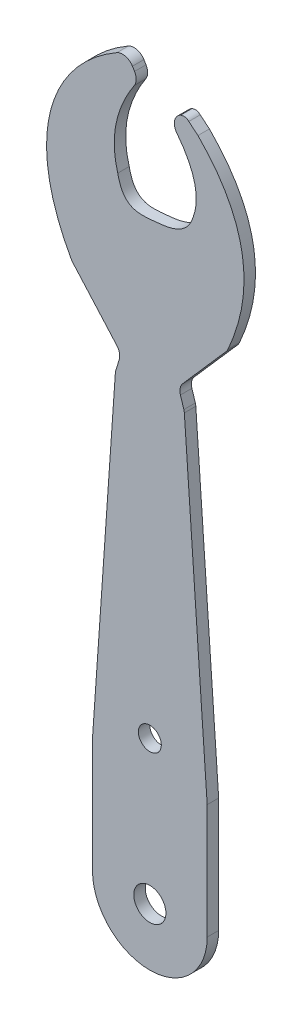
ISO-10303-21;
HEADER;
FILE_DESCRIPTION(('STEP AP214'),'2;1');
FILE_NAME('part.step','',(''),(''),'','','');
FILE_SCHEMA(('AUTOMOTIVE_DESIGN { 1 0 10303 214 1 1 1 1 }'));
ENDSEC;
DATA;
#1=APPLICATION_CONTEXT('core data for automotive mechanical design processes');
#2=APPLICATION_PROTOCOL_DEFINITION('international standard','automotive_design',2000,#1);
#3=PRODUCT_CONTEXT('',#1,'mechanical');
#4=PRODUCT('Part','Part','',(#3));
#5=PRODUCT_RELATED_PRODUCT_CATEGORY('part','',(#4));
#6=PRODUCT_DEFINITION_FORMATION('','',#4);
#7=PRODUCT_DEFINITION_CONTEXT('part definition',#1,'design');
#8=PRODUCT_DEFINITION('design','',#6,#7);
#9=PRODUCT_DEFINITION_SHAPE('','',#8);
#10=(LENGTH_UNIT() NAMED_UNIT(*) SI_UNIT(.MILLI.,.METRE.));
#11=(NAMED_UNIT(*) PLANE_ANGLE_UNIT() SI_UNIT($,.RADIAN.));
#12=(NAMED_UNIT(*) SI_UNIT($,.STERADIAN.) SOLID_ANGLE_UNIT());
#13=UNCERTAINTY_MEASURE_WITH_UNIT(LENGTH_MEASURE(1.E-05),#10,'distance_accuracy_value','');
#14=(GEOMETRIC_REPRESENTATION_CONTEXT(3) GLOBAL_UNCERTAINTY_ASSIGNED_CONTEXT((#13)) GLOBAL_UNIT_ASSIGNED_CONTEXT((#10,
#11,#12)) REPRESENTATION_CONTEXT('',''));
#15=CARTESIAN_POINT('',(0.,0.,0.));
#16=DIRECTION('',(0.,0.,1.));
#17=DIRECTION('',(1.,0.,0.));
#18=AXIS2_PLACEMENT_3D('',#15,#16,#17);
#19=CARTESIAN_POINT('',(42.3332363976536,47.0795023680889,-1.));
#20=CARTESIAN_POINT('',(40.7644229268928,46.1744890731007,-1.));
#21=CARTESIAN_POINT('',(35.8165484060871,41.9007478210855,-1.));
#22=CARTESIAN_POINT('',(35.2720836443385,35.0019493386589,-1.));
#23=CARTESIAN_POINT('',(38.3597162741337,29.485408265831,-1.));
#24=B_SPLINE_CURVE_WITH_KNOTS('',3,(#19,#20,#21,#22,#23),.UNSPECIFIED.,.F.,.F.,(4,1,4),
(0.0040027377368663,0.255811026156907,0.955465838183114),.UNSPECIFIED.);
#25=DIRECTION('',(0.,0.,1.));
#26=VECTOR('',#25,1.);
#27=SURFACE_OF_LINEAR_EXTRUSION('',#24,#26);
#28=CARTESIAN_POINT('',(42.3332363976536,47.0795023680889,0.));
#29=CARTESIAN_POINT('',(40.7644229268928,46.1744890731007,0.));
#30=CARTESIAN_POINT('',(35.8165484060871,41.9007478210855,0.));
#31=CARTESIAN_POINT('',(35.2720836443385,35.0019493386589,0.));
#32=CARTESIAN_POINT('',(38.3597162741337,29.485408265831,0.));
#33=B_SPLINE_CURVE_WITH_KNOTS('',3,(#28,#29,#30,#31,#32),.UNSPECIFIED.,.F.,.F.,(4,1,4),
(0.0040027377368663,0.255811026156907,0.955465838183114),.UNSPECIFIED.);
#34=CARTESIAN_POINT('',(42.3332363976536,47.0795023680889,0.));
#35=VERTEX_POINT('',#34);
#36=CARTESIAN_POINT('',(38.3597162741337,29.485408265831,0.));
#37=VERTEX_POINT('',#36);
#38=EDGE_CURVE('E246',#35,#37,#33,.T.);
#39=ORIENTED_EDGE('',*,*,#38,.F.);
#40=DIRECTION('',(0.,0.,1.));
#41=VECTOR('',#40,1.);
#42=CARTESIAN_POINT('',(42.3332363976536,47.0795023680889,-1.));
#43=LINE('',#42,#41);
#44=CARTESIAN_POINT('',(42.3332363976536,47.0795023680889,-1.));
#45=VERTEX_POINT('',#44);
#46=EDGE_CURVE('E11',#45,#35,#43,.T.);
#47=ORIENTED_EDGE('',*,*,#46,.F.);
#48=CARTESIAN_POINT('',(38.3597162741337,29.485408265831,-1.));
#49=VERTEX_POINT('',#48);
#50=EDGE_CURVE('E351',#45,#49,#24,.T.);
#51=ORIENTED_EDGE('',*,*,#50,.T.);
#52=DIRECTION('',(0.,0.,1.));
#53=VECTOR('',#52,1.);
#54=CARTESIAN_POINT('',(38.3597162741337,29.485408265831,-1.));
#55=LINE('',#54,#53);
#56=EDGE_CURVE('E41',#49,#37,#55,.T.);
#57=ORIENTED_EDGE('',*,*,#56,.T.);
#58=EDGE_LOOP('',(#39,#47,#51,#57));
#59=FACE_BOUND('',#58,.T.);
#60=ADVANCED_FACE('F37',(#59),#27,.T.);
#61=CARTESIAN_POINT('',(42.8329292730268,46.2132997184155,-1.));
#62=DIRECTION('',(0.,0.,1.));
#63=DIRECTION('',(1.,0.,0.));
#64=AXIS2_PLACEMENT_3D('',#61,#62,#63);
#65=CYLINDRICAL_SURFACE('',#64,0.999999999999974);
#66=CARTESIAN_POINT('',(42.8329292730268,46.2132997184155,0.));
#67=DIRECTION('',(0.,0.,1.));
#68=DIRECTION('',(1.,0.,0.));
#69=AXIS2_PLACEMENT_3D('',#66,#67,#68);
#70=CIRCLE('',#69,0.999999999999974);
#71=CARTESIAN_POINT('',(43.6882735895,46.7313596573,0.));
#72=VERTEX_POINT('',#71);
#73=EDGE_CURVE('E349',#72,#35,#70,.T.);
#74=ORIENTED_EDGE('',*,*,#73,.F.);
#75=DIRECTION('',(0.,0.,1.));
#76=VECTOR('',#75,1.);
#77=CARTESIAN_POINT('',(43.6882735895,46.7313596573,-1.));
#78=LINE('',#77,#76);
#79=CARTESIAN_POINT('',(43.6882735895,46.7313596573,-1.));
#80=VERTEX_POINT('',#79);
#81=EDGE_CURVE('E47',#80,#72,#78,.T.);
#82=ORIENTED_EDGE('',*,*,#81,.F.);
#83=CARTESIAN_POINT('',(42.8329292730268,46.2132997184155,-1.));
#84=DIRECTION('',(0.,0.,1.));
#85=DIRECTION('',(1.,0.,0.));
#86=AXIS2_PLACEMENT_3D('',#83,#84,#85);
#87=CIRCLE('',#86,0.999999999999974);
#88=EDGE_CURVE('E233',#80,#45,#87,.T.);
#89=ORIENTED_EDGE('',*,*,#88,.T.);
#90=ORIENTED_EDGE('',*,*,#46,.T.);
#91=EDGE_LOOP('',(#74,#82,#89,#90));
#92=FACE_BOUND('',#91,.T.);
#93=ADVANCED_FACE('F399',(#92),#65,.T.);
#94=CARTESIAN_POINT('',(43.8714355775,46.4289495427,-1.));
#95=DIRECTION('',(0.855344316558168,0.518059938744197,0.));
#96=DIRECTION('',(-0.518059938744197,0.855344316558168,0.));
#97=AXIS2_PLACEMENT_3D('',#94,#95,#96);
#98=PLANE('',#97);
#99=DIRECTION('',(-0.518059938744197,0.855344316558168,0.));
#100=VECTOR('',#99,1.);
#101=CARTESIAN_POINT('',(43.8714355775,46.4289495427,0.));
#102=LINE('',#101,#100);
#103=CARTESIAN_POINT('',(43.8714355775,46.4289495427,0.));
#104=VERTEX_POINT('',#103);
#105=EDGE_CURVE('E220',#104,#72,#102,.T.);
#106=ORIENTED_EDGE('',*,*,#105,.F.);
#107=DIRECTION('',(0.,0.,1.));
#108=VECTOR('',#107,1.);
#109=CARTESIAN_POINT('',(43.8714355775,46.4289495427,-1.));
#110=LINE('',#109,#108);
#111=CARTESIAN_POINT('',(43.8714355775,46.4289495427,-1.));
#112=VERTEX_POINT('',#111);
#113=EDGE_CURVE('E215',#112,#104,#110,.T.);
#114=ORIENTED_EDGE('',*,*,#113,.F.);
#115=DIRECTION('',(-0.518059938744197,0.855344316558168,0.));
#116=VECTOR('',#115,1.);
#117=CARTESIAN_POINT('',(43.8714355775,46.4289495427,-1.));
#118=LINE('',#117,#116);
#119=EDGE_CURVE('E218',#112,#80,#118,.T.);
#120=ORIENTED_EDGE('',*,*,#119,.T.);
#121=ORIENTED_EDGE('',*,*,#81,.T.);
#122=EDGE_LOOP('',(#106,#114,#120,#121));
#123=FACE_BOUND('',#122,.T.);
#124=ADVANCED_FACE('F217',(#123),#98,.T.);
#125=CARTESIAN_POINT('',(43.0160912610668,45.9108896037495,-1.));
#126=DIRECTION('',(0.,0.,1.));
#127=DIRECTION('',(1.,0.,0.));
#128=AXIS2_PLACEMENT_3D('',#125,#126,#127);
#129=CYLINDRICAL_SURFACE('',#128,1.00000000000002);
#130=CARTESIAN_POINT('',(43.0160912610668,45.9108896037495,0.));
#131=DIRECTION('',(0.,0.,1.));
#132=DIRECTION('',(1.,0.,0.));
#133=AXIS2_PLACEMENT_3D('',#130,#131,#132);
#134=CIRCLE('',#133,1.00000000000002);
#135=CARTESIAN_POINT('',(43.8516614433843,45.3615058850046,0.));
#136=VERTEX_POINT('',#135);
#137=EDGE_CURVE('E343',#136,#104,#134,.T.);
#138=ORIENTED_EDGE('',*,*,#137,.F.);
#139=DIRECTION('',(0.,0.,1.));
#140=VECTOR('',#139,1.);
#141=CARTESIAN_POINT('',(43.8516614433843,45.3615058850046,-1.));
#142=LINE('',#141,#140);
#143=CARTESIAN_POINT('',(43.8516614433843,45.3615058850046,-1.));
#144=VERTEX_POINT('',#143);
#145=EDGE_CURVE('E225',#144,#136,#142,.T.);
#146=ORIENTED_EDGE('',*,*,#145,.F.);
#147=CARTESIAN_POINT('',(43.0160912610668,45.9108896037495,-1.));
#148=DIRECTION('',(0.,0.,1.));
#149=DIRECTION('',(1.,0.,0.));
#150=AXIS2_PLACEMENT_3D('',#147,#148,#149);
#151=CIRCLE('',#150,1.00000000000002);
#152=EDGE_CURVE('E231',#144,#112,#151,.T.);
#153=ORIENTED_EDGE('',*,*,#152,.T.);
#154=ORIENTED_EDGE('',*,*,#113,.T.);
#155=EDGE_LOOP('',(#138,#146,#153,#154));
#156=FACE_BOUND('',#155,.T.);
#157=ADVANCED_FACE('F235',(#156),#129,.T.);
#158=CARTESIAN_POINT('',(42.4075432932274,38.0174935312511,-1.));
#159=CARTESIAN_POINT('',(42.322809157617,38.3080987068289,-1.));
#160=CARTESIAN_POINT('',(41.7731764836035,40.6941570879392,-1.));
#161=CARTESIAN_POINT('',(42.3981238843577,43.1507875809266,-1.));
#162=CARTESIAN_POINT('',(43.8516614433843,45.3615058850046,-1.));
#163=B_SPLINE_CURVE_WITH_KNOTS('',3,(#158,#159,#160,#161,#162),.UNSPECIFIED.,.F.,.F.,(4,1,4),
(0.0470284190260174,0.131515029794918,0.738210783890185),.UNSPECIFIED.);
#164=DIRECTION('',(0.,0.,1.));
#165=VECTOR('',#164,1.);
#166=SURFACE_OF_LINEAR_EXTRUSION('',#163,#165);
#167=CARTESIAN_POINT('',(42.4075432932274,38.0174935312511,0.));
#168=CARTESIAN_POINT('',(42.322809157617,38.3080987068289,0.));
#169=CARTESIAN_POINT('',(41.7731764836035,40.6941570879392,0.));
#170=CARTESIAN_POINT('',(42.3981238843577,43.1507875809266,0.));
#171=CARTESIAN_POINT('',(43.8516614433843,45.3615058850046,0.));
#172=B_SPLINE_CURVE_WITH_KNOTS('',3,(#167,#168,#169,#170,#171),.UNSPECIFIED.,.F.,.F.,(4,1,4),
(0.0470284190260174,0.131515029794918,0.738210783890185),.UNSPECIFIED.);
#173=CARTESIAN_POINT('',(42.4075432932274,38.0174935312511,0.));
#174=VERTEX_POINT('',#173);
#175=EDGE_CURVE('E335',#174,#136,#172,.T.);
#176=ORIENTED_EDGE('',*,*,#175,.F.);
#177=DIRECTION('',(0.,0.,1.));
#178=VECTOR('',#177,1.);
#179=CARTESIAN_POINT('',(42.4075432932274,38.0174935312511,-1.));
#180=LINE('',#179,#178);
#181=CARTESIAN_POINT('',(42.4075432932274,38.0174935312511,-1.));
#182=VERTEX_POINT('',#181);
#183=EDGE_CURVE('E355',#182,#174,#180,.T.);
#184=ORIENTED_EDGE('',*,*,#183,.F.);
#185=EDGE_CURVE('E236',#182,#144,#163,.T.);
#186=ORIENTED_EDGE('',*,*,#185,.T.);
#187=ORIENTED_EDGE('',*,*,#145,.T.);
#188=EDGE_LOOP('',(#176,#184,#186,#187));
#189=FACE_BOUND('',#188,.T.);
#190=ADVANCED_FACE('F412',(#189),#166,.T.);
#191=CARTESIAN_POINT('',(48.9681541994678,37.9390061551289,-1.));
#192=CARTESIAN_POINT('',(48.4075300306109,36.2495192598627,-1.));
#193=CARTESIAN_POINT('',(45.517280844346,35.9595964406139,-1.));
#194=CARTESIAN_POINT('',(42.8792154768876,35.7354947461931,-1.));
#195=CARTESIAN_POINT('',(42.4075432932274,38.0174935312511,-1.));
#196=B_SPLINE_CURVE_WITH_KNOTS('',3,(#191,#192,#193,#194,#195),.UNSPECIFIED.,.F.,.F.,(4,1,4),
(0.,0.520046033975967,1.),.UNSPECIFIED.);
#197=DIRECTION('',(0.,0.,1.));
#198=VECTOR('',#197,1.);
#199=SURFACE_OF_LINEAR_EXTRUSION('',#196,#198);
#200=CARTESIAN_POINT('',(48.9681541994678,37.9390061551289,0.));
#201=CARTESIAN_POINT('',(48.4075300306109,36.2495192598627,0.));
#202=CARTESIAN_POINT('',(45.517280844346,35.9595964406139,0.));
#203=CARTESIAN_POINT('',(42.8792154768876,35.7354947461931,0.));
#204=CARTESIAN_POINT('',(42.4075432932274,38.0174935312511,0.));
#205=B_SPLINE_CURVE_WITH_KNOTS('',3,(#200,#201,#202,#203,#204),.UNSPECIFIED.,.F.,.F.,(4,1,4),
(0.,0.520046033975967,1.),.UNSPECIFIED.);
#206=CARTESIAN_POINT('',(48.9681541994678,37.9390061551289,0.));
#207=VERTEX_POINT('',#206);
#208=EDGE_CURVE('E327',#207,#174,#205,.T.);
#209=ORIENTED_EDGE('',*,*,#208,.F.);
#210=DIRECTION('',(0.,0.,1.));
#211=VECTOR('',#210,1.);
#212=CARTESIAN_POINT('',(48.9681541994678,37.9390061551289,-1.));
#213=LINE('',#212,#211);
#214=CARTESIAN_POINT('',(48.9681541994678,37.9390061551289,-1.));
#215=VERTEX_POINT('',#214);
#216=EDGE_CURVE('E357',#215,#207,#213,.T.);
#217=ORIENTED_EDGE('',*,*,#216,.F.);
#218=EDGE_CURVE('E238',#215,#182,#196,.T.);
#219=ORIENTED_EDGE('',*,*,#218,.T.);
#220=ORIENTED_EDGE('',*,*,#183,.T.);
#221=EDGE_LOOP('',(#209,#217,#219,#220));
#222=FACE_BOUND('',#221,.T.);
#223=ADVANCED_FACE('F415',(#222),#199,.T.);
#224=CARTESIAN_POINT('',(47.535799978023,43.6486512493814,-1.));
#225=CARTESIAN_POINT('',(49.1164867980703,41.6205399356762,-1.));
#226=CARTESIAN_POINT('',(49.6339880714659,39.7324042372996,-1.));
#227=CARTESIAN_POINT('',(48.9681541994678,37.9390061551289,-1.));
#228=B_SPLINE_CURVE_WITH_KNOTS('',3,(#224,#225,#226,#227),.UNSPECIFIED.,.F.,.F.,(4,4),(0.,
0.676846711948636),.UNSPECIFIED.);
#229=DIRECTION('',(0.,0.,1.));
#230=VECTOR('',#229,1.);
#231=SURFACE_OF_LINEAR_EXTRUSION('',#228,#230);
#232=CARTESIAN_POINT('',(47.535799978023,43.6486512493814,0.));
#233=CARTESIAN_POINT('',(49.1164867980703,41.6205399356762,0.));
#234=CARTESIAN_POINT('',(49.6339880714659,39.7324042372996,0.));
#235=CARTESIAN_POINT('',(48.9681541994678,37.9390061551289,0.));
#236=B_SPLINE_CURVE_WITH_KNOTS('',3,(#232,#233,#234,#235),.UNSPECIFIED.,.F.,.F.,(4,4),(0.,
0.676846711948636),.UNSPECIFIED.);
#237=CARTESIAN_POINT('',(47.535799978023,43.6486512493814,0.));
#238=VERTEX_POINT('',#237);
#239=EDGE_CURVE('E322',#238,#207,#236,.T.);
#240=ORIENTED_EDGE('',*,*,#239,.F.);
#241=DIRECTION('',(0.,0.,1.));
#242=VECTOR('',#241,1.);
#243=CARTESIAN_POINT('',(47.535799978023,43.6486512493814,-1.));
#244=LINE('',#243,#242);
#245=CARTESIAN_POINT('',(47.535799978023,43.6486512493814,-1.));
#246=VERTEX_POINT('',#245);
#247=EDGE_CURVE('E359',#246,#238,#244,.T.);
#248=ORIENTED_EDGE('',*,*,#247,.F.);
#249=EDGE_CURVE('E427',#246,#215,#228,.T.);
#250=ORIENTED_EDGE('',*,*,#249,.T.);
#251=ORIENTED_EDGE('',*,*,#216,.T.);
#252=EDGE_LOOP('',(#240,#248,#250,#251));
#253=FACE_BOUND('',#252,.T.);
#254=ADVANCED_FACE('F419',(#253),#231,.T.);
#255=CARTESIAN_POINT('',(48.3395201607,44.2436587014,-1.));
#256=DIRECTION('',(0.,0.,1.));
#257=DIRECTION('',(1.,0.,0.));
#258=AXIS2_PLACEMENT_3D('',#255,#256,#257);
#259=CYLINDRICAL_SURFACE('',#258,1.);
#260=CARTESIAN_POINT('',(48.3395201607,44.2436587014,0.));
#261=DIRECTION('',(0.,0.,1.));
#262=DIRECTION('',(1.,0.,0.));
#263=AXIS2_PLACEMENT_3D('',#260,#261,#262);
#264=CIRCLE('',#263,1.);
#265=CARTESIAN_POINT('',(47.8760316315446,45.1297616205586,0.));
#266=VERTEX_POINT('',#265);
#267=EDGE_CURVE('E316',#266,#238,#264,.T.);
#268=ORIENTED_EDGE('',*,*,#267,.F.);
#269=DIRECTION('',(0.,0.,1.));
#270=VECTOR('',#269,1.);
#271=CARTESIAN_POINT('',(47.8760316315446,45.1297616205586,-1.));
#272=LINE('',#271,#270);
#273=CARTESIAN_POINT('',(47.8760316315446,45.1297616205586,-1.));
#274=VERTEX_POINT('',#273);
#275=EDGE_CURVE('E361',#274,#266,#272,.T.);
#276=ORIENTED_EDGE('',*,*,#275,.F.);
#277=CARTESIAN_POINT('',(48.3395201607,44.2436587014,-1.));
#278=DIRECTION('',(0.,0.,1.));
#279=DIRECTION('',(1.,0.,0.));
#280=AXIS2_PLACEMENT_3D('',#277,#278,#279);
#281=CIRCLE('',#280,1.);
#282=EDGE_CURVE('E436',#274,#246,#281,.T.);
#283=ORIENTED_EDGE('',*,*,#282,.T.);
#284=ORIENTED_EDGE('',*,*,#247,.T.);
#285=EDGE_LOOP('',(#268,#276,#283,#284));
#286=FACE_BOUND('',#285,.T.);
#287=ADVANCED_FACE('F458',(#286),#259,.T.);
#288=CARTESIAN_POINT('',(48.6030170784,45.0153900817,-1.));
#289=CARTESIAN_POINT('',(48.4170367582232,45.2047872323035,-1.));
#290=CARTESIAN_POINT('',(48.1747082759381,45.2429110785818,-1.));
#291=CARTESIAN_POINT('',(47.8760316315446,45.1297616205586,-1.));
#292=B_SPLINE_CURVE_WITH_KNOTS('',3,(#288,#289,#290,#291),.UNSPECIFIED.,.F.,.F.,(4,4),(0.,1.),.UNSPECIFIED.);
#293=DIRECTION('',(0.,0.,1.));
#294=VECTOR('',#293,1.);
#295=SURFACE_OF_LINEAR_EXTRUSION('',#292,#294);
#296=CARTESIAN_POINT('',(48.6030170784,45.0153900817,0.));
#297=CARTESIAN_POINT('',(48.4170367582232,45.2047872323035,0.));
#298=CARTESIAN_POINT('',(48.1747082759381,45.2429110785818,0.));
#299=CARTESIAN_POINT('',(47.8760316315446,45.1297616205586,0.));
#300=B_SPLINE_CURVE_WITH_KNOTS('',3,(#296,#297,#298,#299),.UNSPECIFIED.,.F.,.F.,(4,4),(0.,1.),.UNSPECIFIED.);
#301=CARTESIAN_POINT('',(48.6030170784,45.0153900817,0.));
#302=VERTEX_POINT('',#301);
#303=EDGE_CURVE('E311',#302,#266,#300,.T.);
#304=ORIENTED_EDGE('',*,*,#303,.F.);
#305=DIRECTION('',(0.,0.,1.));
#306=VECTOR('',#305,1.);
#307=CARTESIAN_POINT('',(48.6030170784,45.0153900817,-1.));
#308=LINE('',#307,#306);
#309=CARTESIAN_POINT('',(48.6030170784,45.0153900817,-1.));
#310=VERTEX_POINT('',#309);
#311=EDGE_CURVE('E363',#310,#302,#308,.T.);
#312=ORIENTED_EDGE('',*,*,#311,.F.);
#313=EDGE_CURVE('E442',#310,#274,#292,.T.);
#314=ORIENTED_EDGE('',*,*,#313,.T.);
#315=ORIENTED_EDGE('',*,*,#275,.T.);
#316=EDGE_LOOP('',(#304,#312,#314,#315));
#317=FACE_BOUND('',#316,.T.);
#318=ADVANCED_FACE('F454',(#317),#295,.T.);
#319=CARTESIAN_POINT('',(49.3997161082,44.3538951993,-1.));
#320=DIRECTION('',(0.638803605755873,0.769369841671283,0.));
#321=DIRECTION('',(-0.769369841671283,0.638803605755873,0.));
#322=AXIS2_PLACEMENT_3D('',#319,#320,#321);
#323=PLANE('',#322);
#324=DIRECTION('',(-0.769369841671283,0.638803605755873,0.));
#325=VECTOR('',#324,1.);
#326=CARTESIAN_POINT('',(49.3997161082,44.3538951993,0.));
#327=LINE('',#326,#325);
#328=CARTESIAN_POINT('',(49.3997161082,44.3538951993,0.));
#329=VERTEX_POINT('',#328);
#330=EDGE_CURVE('E305',#329,#302,#327,.T.);
#331=ORIENTED_EDGE('',*,*,#330,.F.);
#332=DIRECTION('',(0.,0.,1.));
#333=VECTOR('',#332,1.);
#334=CARTESIAN_POINT('',(49.3997161082,44.3538951993,-1.));
#335=LINE('',#334,#333);
#336=CARTESIAN_POINT('',(49.3997161082,44.3538951993,-1.));
#337=VERTEX_POINT('',#336);
#338=EDGE_CURVE('E365',#337,#329,#335,.T.);
#339=ORIENTED_EDGE('',*,*,#338,.F.);
#340=DIRECTION('',(-0.769369841671283,0.638803605755873,0.));
#341=VECTOR('',#340,1.);
#342=CARTESIAN_POINT('',(49.3997161082,44.3538951993,-1.));
#343=LINE('',#342,#341);
#344=EDGE_CURVE('E448',#337,#310,#343,.T.);
#345=ORIENTED_EDGE('',*,*,#344,.T.);
#346=ORIENTED_EDGE('',*,*,#311,.T.);
#347=EDGE_LOOP('',(#331,#339,#345,#346));
#348=FACE_BOUND('',#347,.T.);
#349=ADVANCED_FACE('F457',(#348),#323,.T.);
#350=CARTESIAN_POINT('',(52.0208186921068,29.5292837811718,-1.));
#351=CARTESIAN_POINT('',(53.2437223596006,32.2584282855217,-1.));
#352=CARTESIAN_POINT('',(54.1005702931095,37.5433855761025,-1.));
#353=CARTESIAN_POINT('',(51.577752865186,42.1664230688072,-1.));
#354=CARTESIAN_POINT('',(49.3997161082,44.3538951993,-1.));
#355=B_SPLINE_CURVE_WITH_KNOTS('',3,(#350,#351,#352,#353,#354),.UNSPECIFIED.,.F.,.F.,(4,1,4),
(0.073238817707767,0.521565521490398,0.992417875054563),.UNSPECIFIED.);
#356=DIRECTION('',(0.,0.,1.));
#357=VECTOR('',#356,1.);
#358=SURFACE_OF_LINEAR_EXTRUSION('',#355,#357);
#359=CARTESIAN_POINT('',(52.0208186921068,29.5292837811718,0.));
#360=CARTESIAN_POINT('',(53.2437223596006,32.2584282855217,0.));
#361=CARTESIAN_POINT('',(54.1005702931095,37.5433855761025,0.));
#362=CARTESIAN_POINT('',(51.577752865186,42.1664230688072,0.));
#363=CARTESIAN_POINT('',(49.3997161082,44.3538951993,0.));
#364=B_SPLINE_CURVE_WITH_KNOTS('',3,(#359,#360,#361,#362,#363),.UNSPECIFIED.,.F.,.F.,(4,1,4),
(0.073238817707767,0.521565521490398,0.992417875054563),.UNSPECIFIED.);
#365=CARTESIAN_POINT('',(52.0208186921068,29.5292837811718,0.));
#366=VERTEX_POINT('',#365);
#367=EDGE_CURVE('E300',#366,#329,#364,.T.);
#368=ORIENTED_EDGE('',*,*,#367,.F.);
#369=DIRECTION('',(0.,0.,1.));
#370=VECTOR('',#369,1.);
#371=CARTESIAN_POINT('',(52.0208186921068,29.5292837811718,-1.));
#372=LINE('',#371,#370);
#373=CARTESIAN_POINT('',(52.0208186921068,29.5292837811718,-1.));
#374=VERTEX_POINT('',#373);
#375=EDGE_CURVE('E367',#374,#366,#372,.T.);
#376=ORIENTED_EDGE('',*,*,#375,.F.);
#377=EDGE_CURVE('E469',#374,#337,#355,.T.);
#378=ORIENTED_EDGE('',*,*,#377,.T.);
#379=ORIENTED_EDGE('',*,*,#338,.T.);
#380=EDGE_LOOP('',(#368,#376,#378,#379));
#381=FACE_BOUND('',#380,.T.);
#382=ADVANCED_FACE('F462',(#381),#358,.T.);
#383=CARTESIAN_POINT('',(51.1082462307573,29.938198812428,-1.));
#384=DIRECTION('',(0.,0.,1.));
#385=DIRECTION('',(1.,0.,0.));
#386=AXIS2_PLACEMENT_3D('',#383,#384,#385);
#387=CYLINDRICAL_SURFACE('',#386,1.00000000000032);
#388=CARTESIAN_POINT('',(51.1082462307573,29.938198812428,0.));
#389=DIRECTION('',(0.,0.,1.));
#390=DIRECTION('',(1.,0.,0.));
#391=AXIS2_PLACEMENT_3D('',#388,#389,#390);
#392=CIRCLE('',#391,1.00000000000032);
#393=CARTESIAN_POINT('',(51.8603389858,29.2791415404,0.));
#394=VERTEX_POINT('',#393);
#395=EDGE_CURVE('E297',#394,#366,#392,.T.);
#396=ORIENTED_EDGE('',*,*,#395,.F.);
#397=DIRECTION('',(0.,0.,1.));
#398=VECTOR('',#397,1.);
#399=CARTESIAN_POINT('',(51.8603389858,29.2791415404,-1.));
#400=LINE('',#399,#398);
#401=CARTESIAN_POINT('',(51.8603389858,29.2791415404,-1.));
#402=VERTEX_POINT('',#401);
#403=EDGE_CURVE('E369',#402,#394,#400,.T.);
#404=ORIENTED_EDGE('',*,*,#403,.F.);
#405=CARTESIAN_POINT('',(51.1082462307573,29.938198812428,-1.));
#406=DIRECTION('',(0.,0.,1.));
#407=DIRECTION('',(1.,0.,0.));
#408=AXIS2_PLACEMENT_3D('',#405,#406,#407);
#409=CIRCLE('',#408,1.00000000000032);
#410=EDGE_CURVE('E475',#402,#374,#409,.T.);
#411=ORIENTED_EDGE('',*,*,#410,.T.);
#412=ORIENTED_EDGE('',*,*,#375,.T.);
#413=EDGE_LOOP('',(#396,#404,#411,#412));
#414=FACE_BOUND('',#413,.T.);
#415=ADVANCED_FACE('F466',(#414),#387,.T.);
#416=CARTESIAN_POINT('',(48.0755558517,24.9600814275,-1.));
#417=DIRECTION('',(0.752092755176524,-0.659057271874747,0.));
#418=DIRECTION('',(0.659057271874747,0.752092755176524,0.));
#419=AXIS2_PLACEMENT_3D('',#416,#417,#418);
#420=PLANE('',#419);
#421=DIRECTION('',(0.659057271874747,0.752092755176524,0.));
#422=VECTOR('',#421,1.);
#423=CARTESIAN_POINT('',(48.0755558517,24.9600814275,0.));
#424=LINE('',#423,#422);
#425=CARTESIAN_POINT('',(48.0755558517,24.9600814275,0.));
#426=VERTEX_POINT('',#425);
#427=EDGE_CURVE('E294',#426,#394,#424,.T.);
#428=ORIENTED_EDGE('',*,*,#427,.F.);
#429=DIRECTION('',(0.,0.,1.));
#430=VECTOR('',#429,1.);
#431=CARTESIAN_POINT('',(48.0755558517,24.9600814275,-1.));
#432=LINE('',#431,#430);
#433=CARTESIAN_POINT('',(48.0755558517,24.9600814275,-1.));
#434=VERTEX_POINT('',#433);
#435=EDGE_CURVE('E371',#434,#426,#432,.T.);
#436=ORIENTED_EDGE('',*,*,#435,.F.);
#437=DIRECTION('',(0.659057271874747,0.752092755176524,0.));
#438=VECTOR('',#437,1.);
#439=CARTESIAN_POINT('',(48.0755558517,24.9600814275,-1.));
#440=LINE('',#439,#438);
#441=EDGE_CURVE('E481',#434,#402,#440,.T.);
#442=ORIENTED_EDGE('',*,*,#441,.T.);
#443=ORIENTED_EDGE('',*,*,#403,.T.);
#444=EDGE_LOOP('',(#428,#436,#442,#443));
#445=FACE_BOUND('',#444,.T.);
#446=ADVANCED_FACE('F612',(#445),#420,.T.);
#447=CARTESIAN_POINT('',(48.8276486068736,24.3010241556231,-1.));
#448=DIRECTION('',(0.,0.,1.));
#449=DIRECTION('',(1.,0.,0.));
#450=AXIS2_PLACEMENT_3D('',#447,#448,#449);
#451=CYLINDRICAL_SURFACE('',#450,0.999999999999286);
#452=CARTESIAN_POINT('',(48.8276486068736,24.3010241556231,0.));
#453=DIRECTION('',(0.,0.,-1.));
#454=DIRECTION('',(1.,0.,0.));
#455=AXIS2_PLACEMENT_3D('',#452,#453,#454);
#456=CIRCLE('',#455,0.999999999999286);
#457=CARTESIAN_POINT('',(47.873069238,24.0030673995,0.));
#458=VERTEX_POINT('',#457);
#459=EDGE_CURVE('E291',#458,#426,#456,.T.);
#460=ORIENTED_EDGE('',*,*,#459,.F.);
#461=DIRECTION('',(0.,0.,1.));
#462=VECTOR('',#461,1.);
#463=CARTESIAN_POINT('',(47.873069238,24.0030673995,-1.));
#464=LINE('',#463,#462);
#465=CARTESIAN_POINT('',(47.873069238,24.0030673995,-1.));
#466=VERTEX_POINT('',#465);
#467=EDGE_CURVE('E373',#466,#458,#464,.T.);
#468=ORIENTED_EDGE('',*,*,#467,.F.);
#469=CARTESIAN_POINT('',(48.8276486068736,24.3010241556231,-1.));
#470=DIRECTION('',(0.,0.,-1.));
#471=DIRECTION('',(1.,0.,0.));
#472=AXIS2_PLACEMENT_3D('',#469,#470,#471);
#473=CIRCLE('',#472,0.999999999999286);
#474=EDGE_CURVE('E484',#466,#434,#473,.T.);
#475=ORIENTED_EDGE('',*,*,#474,.T.);
#476=ORIENTED_EDGE('',*,*,#435,.T.);
#477=EDGE_LOOP('',(#460,#468,#475,#476));
#478=FACE_BOUND('',#477,.T.);
#479=ADVANCED_FACE('F609',(#478),#451,.F.);
#480=CARTESIAN_POINT('',(48.1711246513,23.0481719577,-1.));
#481=DIRECTION('',(0.954579368861853,0.297956756163216,0.));
#482=DIRECTION('',(-0.297956756163216,0.954579368861853,0.));
#483=AXIS2_PLACEMENT_3D('',#480,#481,#482);
#484=PLANE('',#483);
#485=DIRECTION('',(-0.297956756163216,0.954579368861853,0.));
#486=VECTOR('',#485,1.);
#487=CARTESIAN_POINT('',(48.1711246513,23.0481719577,0.));
#488=LINE('',#487,#486);
#489=CARTESIAN_POINT('',(48.1711246513,23.0481719577,0.));
#490=VERTEX_POINT('',#489);
#491=EDGE_CURVE('E288',#490,#458,#488,.T.);
#492=ORIENTED_EDGE('',*,*,#491,.F.);
#493=DIRECTION('',(0.,0.,1.));
#494=VECTOR('',#493,1.);
#495=CARTESIAN_POINT('',(48.1711246513,23.0481719577,-1.));
#496=LINE('',#495,#494);
#497=CARTESIAN_POINT('',(48.1711246513,23.0481719577,-1.));
#498=VERTEX_POINT('',#497);
#499=EDGE_CURVE('E375',#498,#490,#496,.T.);
#500=ORIENTED_EDGE('',*,*,#499,.F.);
#501=DIRECTION('',(-0.297956756163216,0.954579368861853,0.));
#502=VECTOR('',#501,1.);
#503=CARTESIAN_POINT('',(48.1711246513,23.0481719577,-1.));
#504=LINE('',#503,#502);
#505=EDGE_CURVE('E487',#498,#466,#504,.T.);
#506=ORIENTED_EDGE('',*,*,#505,.T.);
#507=ORIENTED_EDGE('',*,*,#467,.T.);
#508=EDGE_LOOP('',(#492,#500,#506,#507));
#509=FACE_BOUND('',#508,.T.);
#510=ADVANCED_FACE('F605',(#509),#484,.T.);
#511=CARTESIAN_POINT('',(47.2165452824608,22.7502152014648,-1.));
#512=DIRECTION('',(0.,0.,1.));
#513=DIRECTION('',(1.,0.,0.));
#514=AXIS2_PLACEMENT_3D('',#511,#512,#513);
#515=CYLINDRICAL_SURFACE('',#514,0.999999999999812);
#516=CARTESIAN_POINT('',(47.2165452824608,22.7502152014648,0.));
#517=DIRECTION('',(0.,0.,1.));
#518=DIRECTION('',(1.,0.,0.));
#519=AXIS2_PLACEMENT_3D('',#516,#517,#518);
#520=CIRCLE('',#519,0.999999999999812);
#521=CARTESIAN_POINT('',(48.2141256618,22.8197377644,0.));
#522=VERTEX_POINT('',#521);
#523=EDGE_CURVE('E285',#522,#490,#520,.T.);
#524=ORIENTED_EDGE('',*,*,#523,.F.);
#525=DIRECTION('',(0.,0.,1.));
#526=VECTOR('',#525,1.);
#527=CARTESIAN_POINT('',(48.2141256618,22.8197377644,-1.));
#528=LINE('',#527,#526);
#529=CARTESIAN_POINT('',(48.2141256618,22.8197377644,-1.));
#530=VERTEX_POINT('',#529);
#531=EDGE_CURVE('E377',#530,#522,#528,.T.);
#532=ORIENTED_EDGE('',*,*,#531,.F.);
#533=CARTESIAN_POINT('',(47.2165452824608,22.7502152014648,-1.));
#534=DIRECTION('',(0.,0.,1.));
#535=DIRECTION('',(1.,0.,0.));
#536=AXIS2_PLACEMENT_3D('',#533,#534,#535);
#537=CIRCLE('',#536,0.999999999999812);
#538=EDGE_CURVE('E490',#530,#498,#537,.T.);
#539=ORIENTED_EDGE('',*,*,#538,.T.);
#540=ORIENTED_EDGE('',*,*,#499,.T.);
#541=EDGE_LOOP('',(#524,#532,#539,#540));
#542=FACE_BOUND('',#541,.T.);
#543=ADVANCED_FACE('F601',(#542),#515,.T.);
#544=CARTESIAN_POINT('',(50.2059904,-5.7615616,-1.));
#545=DIRECTION('',(0.997580379345954,0.0695225628410157,0.));
#546=DIRECTION('',(-0.0695225628410157,0.997580379345954,0.));
#547=AXIS2_PLACEMENT_3D('',#544,#545,#546);
#548=PLANE('',#547);
#549=DIRECTION('',(-0.0695225628410157,0.997580379345954,0.));
#550=VECTOR('',#549,1.);
#551=CARTESIAN_POINT('',(50.2059904,-5.7615616,0.));
#552=LINE('',#551,#550);
#553=CARTESIAN_POINT('',(50.2059904,-5.7615616,0.));
#554=VERTEX_POINT('',#553);
#555=EDGE_CURVE('E282',#554,#522,#552,.T.);
#556=ORIENTED_EDGE('',*,*,#555,.F.);
#557=DIRECTION('',(0.,0.,1.));
#558=VECTOR('',#557,1.);
#559=CARTESIAN_POINT('',(50.2059904,-5.7615616,-1.));
#560=LINE('',#559,#558);
#561=CARTESIAN_POINT('',(50.2059904,-5.7615616,-1.));
#562=VERTEX_POINT('',#561);
#563=EDGE_CURVE('E379',#562,#554,#560,.T.);
#564=ORIENTED_EDGE('',*,*,#563,.F.);
#565=DIRECTION('',(-0.0695225628410157,0.997580379345954,0.));
#566=VECTOR('',#565,1.);
#567=CARTESIAN_POINT('',(50.2059904,-5.7615616,-1.));
#568=LINE('',#567,#566);
#569=EDGE_CURVE('E493',#562,#530,#568,.T.);
#570=ORIENTED_EDGE('',*,*,#569,.T.);
#571=ORIENTED_EDGE('',*,*,#531,.T.);
#572=EDGE_LOOP('',(#556,#564,#570,#571));
#573=FACE_BOUND('',#572,.T.);
#574=ADVANCED_FACE('F597',(#573),#548,.T.);
#575=CARTESIAN_POINT('',(50.2059904,-15.7615616,-1.));
#576=DIRECTION('',(1.,0.,0.));
#577=DIRECTION('',(0.,0.,-1.));
#578=AXIS2_PLACEMENT_3D('',#575,#576,#577);
#579=PLANE('',#578);
#580=DIRECTION('',(0.,1.,0.));
#581=VECTOR('',#580,1.);
#582=CARTESIAN_POINT('',(50.2059904,-15.7615616,0.));
#583=LINE('',#582,#581);
#584=CARTESIAN_POINT('',(50.2059904,-15.7615616,0.));
#585=VERTEX_POINT('',#584);
#586=EDGE_CURVE('E279',#585,#554,#583,.T.);
#587=ORIENTED_EDGE('',*,*,#586,.F.);
#588=DIRECTION('',(0.,0.,1.));
#589=VECTOR('',#588,1.);
#590=CARTESIAN_POINT('',(50.2059904,-15.7615616,-1.));
#591=LINE('',#590,#589);
#592=CARTESIAN_POINT('',(50.2059904,-15.7615616,-1.));
#593=VERTEX_POINT('',#592);
#594=EDGE_CURVE('E381',#593,#585,#591,.T.);
#595=ORIENTED_EDGE('',*,*,#594,.F.);
#596=DIRECTION('',(0.,1.,0.));
#597=VECTOR('',#596,1.);
#598=CARTESIAN_POINT('',(50.2059904,-15.7615616,-1.));
#599=LINE('',#598,#597);
#600=EDGE_CURVE('E496',#593,#562,#599,.T.);
#601=ORIENTED_EDGE('',*,*,#600,.T.);
#602=ORIENTED_EDGE('',*,*,#563,.T.);
#603=EDGE_LOOP('',(#587,#595,#601,#602));
#604=FACE_BOUND('',#603,.T.);
#605=ADVANCED_FACE('F593',(#604),#579,.T.);
#606=CARTESIAN_POINT('',(45.2059904,-15.7615616,-1.));
#607=DIRECTION('',(0.,0.,1.));
#608=DIRECTION('',(1.,0.,0.));
#609=AXIS2_PLACEMENT_3D('',#606,#607,#608);
#610=CYLINDRICAL_SURFACE('',#609,5.);
#611=CARTESIAN_POINT('',(45.2059904,-15.7615616,0.));
#612=DIRECTION('',(0.,0.,1.));
#613=DIRECTION('',(1.,0.,0.));
#614=AXIS2_PLACEMENT_3D('',#611,#612,#613);
#615=CIRCLE('',#614,5.);
#616=CARTESIAN_POINT('',(40.2059904,-15.7615616,0.));
#617=VERTEX_POINT('',#616);
#618=EDGE_CURVE('E276',#617,#585,#615,.T.);
#619=ORIENTED_EDGE('',*,*,#618,.F.);
#620=DIRECTION('',(0.,0.,1.));
#621=VECTOR('',#620,1.);
#622=CARTESIAN_POINT('',(40.2059904,-15.7615616,-1.));
#623=LINE('',#622,#621);
#624=CARTESIAN_POINT('',(40.2059904,-15.7615616,-1.));
#625=VERTEX_POINT('',#624);
#626=EDGE_CURVE('E383',#625,#617,#623,.T.);
#627=ORIENTED_EDGE('',*,*,#626,.F.);
#628=CARTESIAN_POINT('',(45.2059904,-15.7615616,-1.));
#629=DIRECTION('',(0.,0.,1.));
#630=DIRECTION('',(1.,0.,0.));
#631=AXIS2_PLACEMENT_3D('',#628,#629,#630);
#632=CIRCLE('',#631,5.);
#633=EDGE_CURVE('E499',#625,#593,#632,.T.);
#634=ORIENTED_EDGE('',*,*,#633,.T.);
#635=ORIENTED_EDGE('',*,*,#594,.T.);
#636=EDGE_LOOP('',(#619,#627,#634,#635));
#637=FACE_BOUND('',#636,.T.);
#638=ADVANCED_FACE('F589',(#637),#610,.T.);
#639=CARTESIAN_POINT('',(40.2059904,-5.7615616,-1.));
#640=DIRECTION('',(-1.,0.,0.));
#641=DIRECTION('',(0.,0.,1.));
#642=AXIS2_PLACEMENT_3D('',#639,#640,#641);
#643=PLANE('',#642);
#644=DIRECTION('',(0.,-1.,0.));
#645=VECTOR('',#644,1.);
#646=CARTESIAN_POINT('',(40.2059904,-5.7615616,0.));
#647=LINE('',#646,#645);
#648=CARTESIAN_POINT('',(40.2059904,-5.7615616,0.));
#649=VERTEX_POINT('',#648);
#650=EDGE_CURVE('E273',#649,#617,#647,.T.);
#651=ORIENTED_EDGE('',*,*,#650,.F.);
#652=DIRECTION('',(0.,0.,1.));
#653=VECTOR('',#652,1.);
#654=CARTESIAN_POINT('',(40.2059904,-5.7615616,-1.));
#655=LINE('',#654,#653);
#656=CARTESIAN_POINT('',(40.2059904,-5.7615616,-1.));
#657=VERTEX_POINT('',#656);
#658=EDGE_CURVE('E385',#657,#649,#655,.T.);
#659=ORIENTED_EDGE('',*,*,#658,.F.);
#660=DIRECTION('',(0.,-1.,0.));
#661=VECTOR('',#660,1.);
#662=CARTESIAN_POINT('',(40.2059904,-5.7615616,-1.));
#663=LINE('',#662,#661);
#664=EDGE_CURVE('E502',#657,#625,#663,.T.);
#665=ORIENTED_EDGE('',*,*,#664,.T.);
#666=ORIENTED_EDGE('',*,*,#626,.T.);
#667=EDGE_LOOP('',(#651,#659,#665,#666));
#668=FACE_BOUND('',#667,.T.);
#669=ADVANCED_FACE('F585',(#668),#643,.T.);
#670=CARTESIAN_POINT('',(42.1978551382,22.8197377644,-1.));
#671=DIRECTION('',(-0.997580379345954,0.069522562841016,0.));
#672=DIRECTION('',(-0.069522562841016,-0.997580379345954,0.));
#673=AXIS2_PLACEMENT_3D('',#670,#671,#672);
#674=PLANE('',#673);
#675=DIRECTION('',(-0.069522562841016,-0.997580379345954,0.));
#676=VECTOR('',#675,1.);
#677=CARTESIAN_POINT('',(42.1978551382,22.8197377644,0.));
#678=LINE('',#677,#676);
#679=CARTESIAN_POINT('',(42.1978551382,22.8197377644,0.));
#680=VERTEX_POINT('',#679);
#681=EDGE_CURVE('E270',#680,#649,#678,.T.);
#682=ORIENTED_EDGE('',*,*,#681,.F.);
#683=DIRECTION('',(0.,0.,1.));
#684=VECTOR('',#683,1.);
#685=CARTESIAN_POINT('',(42.1978551382,22.8197377644,-1.));
#686=LINE('',#685,#684);
#687=CARTESIAN_POINT('',(42.1978551382,22.8197377644,-1.));
#688=VERTEX_POINT('',#687);
#689=EDGE_CURVE('E387',#688,#680,#686,.T.);
#690=ORIENTED_EDGE('',*,*,#689,.F.);
#691=DIRECTION('',(-0.069522562841016,-0.997580379345954,0.));
#692=VECTOR('',#691,1.);
#693=CARTESIAN_POINT('',(42.1978551382,22.8197377644,-1.));
#694=LINE('',#693,#692);
#695=EDGE_CURVE('E505',#688,#657,#694,.T.);
#696=ORIENTED_EDGE('',*,*,#695,.T.);
#697=ORIENTED_EDGE('',*,*,#658,.T.);
#698=EDGE_LOOP('',(#682,#690,#696,#697));
#699=FACE_BOUND('',#698,.T.);
#700=ADVANCED_FACE('F581',(#699),#674,.T.);
#701=CARTESIAN_POINT('',(43.1954355175391,22.7502152014649,-1.));
#702=DIRECTION('',(0.,0.,1.));
#703=DIRECTION('',(1.,0.,0.));
#704=AXIS2_PLACEMENT_3D('',#701,#702,#703);
#705=CYLINDRICAL_SURFACE('',#704,0.999999999999655);
#706=CARTESIAN_POINT('',(43.1954355175391,22.7502152014649,0.));
#707=DIRECTION('',(0.,0.,1.));
#708=DIRECTION('',(1.,0.,0.));
#709=AXIS2_PLACEMENT_3D('',#706,#707,#708);
#710=CIRCLE('',#709,0.999999999999655);
#711=CARTESIAN_POINT('',(42.2408561487,23.0481719577,0.));
#712=VERTEX_POINT('',#711);
#713=EDGE_CURVE('E267',#712,#680,#710,.T.);
#714=ORIENTED_EDGE('',*,*,#713,.F.);
#715=DIRECTION('',(0.,0.,1.));
#716=VECTOR('',#715,1.);
#717=CARTESIAN_POINT('',(42.2408561487,23.0481719577,-1.));
#718=LINE('',#717,#716);
#719=CARTESIAN_POINT('',(42.2408561487,23.0481719577,-1.));
#720=VERTEX_POINT('',#719);
#721=EDGE_CURVE('E389',#720,#712,#718,.T.);
#722=ORIENTED_EDGE('',*,*,#721,.F.);
#723=CARTESIAN_POINT('',(43.1954355175391,22.7502152014649,-1.));
#724=DIRECTION('',(0.,0.,1.));
#725=DIRECTION('',(1.,0.,0.));
#726=AXIS2_PLACEMENT_3D('',#723,#724,#725);
#727=CIRCLE('',#726,0.999999999999655);
#728=EDGE_CURVE('E508',#720,#688,#727,.T.);
#729=ORIENTED_EDGE('',*,*,#728,.T.);
#730=ORIENTED_EDGE('',*,*,#689,.T.);
#731=EDGE_LOOP('',(#714,#722,#729,#730));
#732=FACE_BOUND('',#731,.T.);
#733=ADVANCED_FACE('F577',(#732),#705,.T.);
#734=CARTESIAN_POINT('',(42.537981803,24.0000886827,-1.));
#735=DIRECTION('',(-0.954579368851141,0.297956756197535,0.));
#736=DIRECTION('',(-0.297956756197535,-0.954579368851141,0.));
#737=AXIS2_PLACEMENT_3D('',#734,#735,#736);
#738=PLANE('',#737);
#739=DIRECTION('',(-0.297956756197535,-0.954579368851141,0.));
#740=VECTOR('',#739,1.);
#741=CARTESIAN_POINT('',(42.537981803,24.0000886827,0.));
#742=LINE('',#741,#740);
#743=CARTESIAN_POINT('',(42.537981803,24.0000886827,0.));
#744=VERTEX_POINT('',#743);
#745=EDGE_CURVE('E264',#744,#712,#742,.T.);
#746=ORIENTED_EDGE('',*,*,#745,.F.);
#747=DIRECTION('',(0.,0.,1.));
#748=VECTOR('',#747,1.);
#749=CARTESIAN_POINT('',(42.537981803,24.0000886827,-1.));
#750=LINE('',#749,#748);
#751=CARTESIAN_POINT('',(42.537981803,24.0000886827,-1.));
#752=VERTEX_POINT('',#751);
#753=EDGE_CURVE('E391',#752,#744,#750,.T.);
#754=ORIENTED_EDGE('',*,*,#753,.F.);
#755=DIRECTION('',(-0.297956756197535,-0.954579368851141,0.));
#756=VECTOR('',#755,1.);
#757=CARTESIAN_POINT('',(42.537981803,24.0000886827,-1.));
#758=LINE('',#757,#756);
#759=EDGE_CURVE('E511',#752,#720,#758,.T.);
#760=ORIENTED_EDGE('',*,*,#759,.T.);
#761=ORIENTED_EDGE('',*,*,#721,.T.);
#762=EDGE_LOOP('',(#746,#754,#760,#761));
#763=FACE_BOUND('',#762,.T.);
#764=ADVANCED_FACE('F573',(#763),#738,.T.);
#765=CARTESIAN_POINT('',(41.5834024341243,24.2980454388188,-1.));
#766=DIRECTION('',(0.,0.,1.));
#767=DIRECTION('',(1.,0.,0.));
#768=AXIS2_PLACEMENT_3D('',#765,#766,#767);
#769=CYLINDRICAL_SURFACE('',#768,0.99999999999995);
#770=CARTESIAN_POINT('',(41.5834024341243,24.2980454388188,0.));
#771=DIRECTION('',(0.,0.,-1.));
#772=DIRECTION('',(1.,0.,0.));
#773=AXIS2_PLACEMENT_3D('',#770,#771,#772);
#774=CIRCLE('',#773,0.99999999999995);
#775=CARTESIAN_POINT('',(42.332361737,24.9606614382,0.));
#776=VERTEX_POINT('',#775);
#777=EDGE_CURVE('E261',#776,#744,#774,.T.);
#778=ORIENTED_EDGE('',*,*,#777,.F.);
#779=DIRECTION('',(0.,0.,1.));
#780=VECTOR('',#779,1.);
#781=CARTESIAN_POINT('',(42.332361737,24.9606614382,-1.));
#782=LINE('',#781,#780);
#783=CARTESIAN_POINT('',(42.332361737,24.9606614382,-1.));
#784=VERTEX_POINT('',#783);
#785=EDGE_CURVE('E393',#784,#776,#782,.T.);
#786=ORIENTED_EDGE('',*,*,#785,.F.);
#787=CARTESIAN_POINT('',(41.5834024341243,24.2980454388188,-1.));
#788=DIRECTION('',(0.,0.,-1.));
#789=DIRECTION('',(1.,0.,0.));
#790=AXIS2_PLACEMENT_3D('',#787,#788,#789);
#791=CIRCLE('',#790,0.99999999999995);
#792=EDGE_CURVE('E514',#784,#752,#791,.T.);
#793=ORIENTED_EDGE('',*,*,#792,.T.);
#794=ORIENTED_EDGE('',*,*,#753,.T.);
#795=EDGE_LOOP('',(#778,#786,#793,#794));
#796=FACE_BOUND('',#795,.T.);
#797=ADVANCED_FACE('F567',(#796),#769,.F.);
#798=CARTESIAN_POINT('',(38.4833729081,29.3111992963,-1.));
#799=DIRECTION('',(-0.748959302946581,-0.662615999301082,0.));
#800=DIRECTION('',(0.662615999301082,-0.748959302946581,0.));
#801=AXIS2_PLACEMENT_3D('',#798,#799,#800);
#802=PLANE('',#801);
#803=DIRECTION('',(0.662615999301082,-0.748959302946581,0.));
#804=VECTOR('',#803,1.);
#805=CARTESIAN_POINT('',(38.4833729081,29.3111992963,0.));
#806=LINE('',#805,#804);
#807=CARTESIAN_POINT('',(38.4833729081,29.3111992963,0.));
#808=VERTEX_POINT('',#807);
#809=EDGE_CURVE('E258',#808,#776,#806,.T.);
#810=ORIENTED_EDGE('',*,*,#809,.F.);
#811=DIRECTION('',(0.,0.,1.));
#812=VECTOR('',#811,1.);
#813=CARTESIAN_POINT('',(38.4833729081,29.3111992963,-1.));
#814=LINE('',#813,#812);
#815=CARTESIAN_POINT('',(38.4833729081,29.3111992963,-1.));
#816=VERTEX_POINT('',#815);
#817=EDGE_CURVE('E394',#816,#808,#814,.T.);
#818=ORIENTED_EDGE('',*,*,#817,.F.);
#819=DIRECTION('',(0.662615999301082,-0.748959302946581,0.));
#820=VECTOR('',#819,1.);
#821=CARTESIAN_POINT('',(38.4833729081,29.3111992963,-1.));
#822=LINE('',#821,#820);
#823=EDGE_CURVE('E517',#816,#784,#822,.T.);
#824=ORIENTED_EDGE('',*,*,#823,.T.);
#825=ORIENTED_EDGE('',*,*,#785,.T.);
#826=EDGE_LOOP('',(#810,#818,#824,#825));
#827=FACE_BOUND('',#826,.T.);
#828=ADVANCED_FACE('F563',(#827),#802,.T.);
#829=CARTESIAN_POINT('',(39.2323322109173,29.9738152957478,-1.));
#830=DIRECTION('',(0.,0.,1.));
#831=DIRECTION('',(1.,0.,0.));
#832=AXIS2_PLACEMENT_3D('',#829,#830,#831);
#833=CYLINDRICAL_SURFACE('',#832,1.00000000000037);
#834=CARTESIAN_POINT('',(39.2323322109173,29.9738152957478,0.));
#835=DIRECTION('',(0.,0.,1.));
#836=DIRECTION('',(1.,0.,0.));
#837=AXIS2_PLACEMENT_3D('',#834,#835,#836);
#838=CIRCLE('',#837,1.00000000000037);
#839=EDGE_CURVE('E251',#37,#808,#838,.T.);
#840=ORIENTED_EDGE('',*,*,#839,.F.);
#841=ORIENTED_EDGE('',*,*,#56,.F.);
#842=CARTESIAN_POINT('',(39.2323322109173,29.9738152957478,-1.));
#843=DIRECTION('',(0.,0.,1.));
#844=DIRECTION('',(1.,0.,0.));
#845=AXIS2_PLACEMENT_3D('',#842,#843,#844);
#846=CIRCLE('',#845,1.00000000000037);
#847=EDGE_CURVE('E520',#49,#816,#846,.T.);
#848=ORIENTED_EDGE('',*,*,#847,.T.);
#849=ORIENTED_EDGE('',*,*,#817,.T.);
#850=EDGE_LOOP('',(#840,#841,#848,#849));
#851=FACE_BOUND('',#850,.T.);
#852=ADVANCED_FACE('F396',(#851),#833,.T.);
#853=CARTESIAN_POINT('',(36.5512837991038,39.8163731078872,-1.));
#854=DIRECTION('',(0.,0.,-1.));
#855=DIRECTION('',(-1.,0.,0.));
#856=AXIS2_PLACEMENT_3D('',#853,#854,#855);
#857=PLANE('',#856);
#858=CARTESIAN_POINT('',(45.2059904,-3.2615616,-1.));
#859=DIRECTION('',(0.,0.,1.));
#860=DIRECTION('',(1.,0.,0.));
#861=AXIS2_PLACEMENT_3D('',#858,#859,#860);
#862=CIRCLE('',#861,0.999999999958409);
#863=CARTESIAN_POINT('',(46.2059903999584,-3.2615616,-1.));
#864=VERTEX_POINT('',#863);
#865=EDGE_CURVE('E531',#864,#864,#862,.T.);
#866=ORIENTED_EDGE('',*,*,#865,.T.);
#867=EDGE_LOOP('',(#866));
#868=FACE_BOUND('',#867,.T.);
#869=CARTESIAN_POINT('',(45.2059904,-15.7615616,-1.));
#870=DIRECTION('',(0.,0.,1.));
#871=DIRECTION('',(1.,0.,0.));
#872=AXIS2_PLACEMENT_3D('',#869,#870,#871);
#873=CIRCLE('',#872,1.39999999995841);
#874=CARTESIAN_POINT('',(46.6059903999584,-15.7615616,-1.));
#875=VERTEX_POINT('',#874);
#876=EDGE_CURVE('E252',#875,#875,#873,.T.);
#877=ORIENTED_EDGE('',*,*,#876,.T.);
#878=EDGE_LOOP('',(#877));
#879=FACE_BOUND('',#878,.T.);
#880=ORIENTED_EDGE('',*,*,#50,.F.);
#881=ORIENTED_EDGE('',*,*,#88,.F.);
#882=ORIENTED_EDGE('',*,*,#119,.F.);
#883=ORIENTED_EDGE('',*,*,#152,.F.);
#884=ORIENTED_EDGE('',*,*,#185,.F.);
#885=ORIENTED_EDGE('',*,*,#218,.F.);
#886=ORIENTED_EDGE('',*,*,#249,.F.);
#887=ORIENTED_EDGE('',*,*,#282,.F.);
#888=ORIENTED_EDGE('',*,*,#313,.F.);
#889=ORIENTED_EDGE('',*,*,#344,.F.);
#890=ORIENTED_EDGE('',*,*,#377,.F.);
#891=ORIENTED_EDGE('',*,*,#410,.F.);
#892=ORIENTED_EDGE('',*,*,#441,.F.);
#893=ORIENTED_EDGE('',*,*,#474,.F.);
#894=ORIENTED_EDGE('',*,*,#505,.F.);
#895=ORIENTED_EDGE('',*,*,#538,.F.);
#896=ORIENTED_EDGE('',*,*,#569,.F.);
#897=ORIENTED_EDGE('',*,*,#600,.F.);
#898=ORIENTED_EDGE('',*,*,#633,.F.);
#899=ORIENTED_EDGE('',*,*,#664,.F.);
#900=ORIENTED_EDGE('',*,*,#695,.F.);
#901=ORIENTED_EDGE('',*,*,#728,.F.);
#902=ORIENTED_EDGE('',*,*,#759,.F.);
#903=ORIENTED_EDGE('',*,*,#792,.F.);
#904=ORIENTED_EDGE('',*,*,#823,.F.);
#905=ORIENTED_EDGE('',*,*,#847,.F.);
#906=EDGE_LOOP('',(#880,#881,#882,#883,#884,#885,#886,#887,#888,#889,#890,#891,#892,#893,#894,
#895,#896,#897,#898,#899,#900,#901,#902,#903,#904,#905));
#907=FACE_BOUND('',#906,.T.);
#908=ADVANCED_FACE('F229',(#868,#879,#907),#857,.T.);
#909=CARTESIAN_POINT('',(36.5512837991038,39.8163731078872,0.));
#910=DIRECTION('',(0.,0.,-1.));
#911=DIRECTION('',(-1.,0.,0.));
#912=AXIS2_PLACEMENT_3D('',#909,#910,#911);
#913=PLANE('',#912);
#914=CARTESIAN_POINT('',(45.2059904,-3.2615616,0.));
#915=DIRECTION('',(0.,0.,1.));
#916=DIRECTION('',(1.,0.,0.));
#917=AXIS2_PLACEMENT_3D('',#914,#915,#916);
#918=CIRCLE('',#917,0.999999999958409);
#919=CARTESIAN_POINT('',(46.2059903999584,-3.2615616,0.));
#920=VERTEX_POINT('',#919);
#921=EDGE_CURVE('E534',#920,#920,#918,.T.);
#922=ORIENTED_EDGE('',*,*,#921,.F.);
#923=EDGE_LOOP('',(#922));
#924=FACE_BOUND('',#923,.T.);
#925=CARTESIAN_POINT('',(45.2059904,-15.7615616,0.));
#926=DIRECTION('',(0.,0.,1.));
#927=DIRECTION('',(1.,0.,0.));
#928=AXIS2_PLACEMENT_3D('',#925,#926,#927);
#929=CIRCLE('',#928,1.39999999995841);
#930=CARTESIAN_POINT('',(46.6059903999584,-15.7615616,0.));
#931=VERTEX_POINT('',#930);
#932=EDGE_CURVE('E525',#931,#931,#929,.T.);
#933=ORIENTED_EDGE('',*,*,#932,.F.);
#934=EDGE_LOOP('',(#933));
#935=FACE_BOUND('',#934,.T.);
#936=ORIENTED_EDGE('',*,*,#38,.T.);
#937=ORIENTED_EDGE('',*,*,#839,.T.);
#938=ORIENTED_EDGE('',*,*,#809,.T.);
#939=ORIENTED_EDGE('',*,*,#777,.T.);
#940=ORIENTED_EDGE('',*,*,#745,.T.);
#941=ORIENTED_EDGE('',*,*,#713,.T.);
#942=ORIENTED_EDGE('',*,*,#681,.T.);
#943=ORIENTED_EDGE('',*,*,#650,.T.);
#944=ORIENTED_EDGE('',*,*,#618,.T.);
#945=ORIENTED_EDGE('',*,*,#586,.T.);
#946=ORIENTED_EDGE('',*,*,#555,.T.);
#947=ORIENTED_EDGE('',*,*,#523,.T.);
#948=ORIENTED_EDGE('',*,*,#491,.T.);
#949=ORIENTED_EDGE('',*,*,#459,.T.);
#950=ORIENTED_EDGE('',*,*,#427,.T.);
#951=ORIENTED_EDGE('',*,*,#395,.T.);
#952=ORIENTED_EDGE('',*,*,#367,.T.);
#953=ORIENTED_EDGE('',*,*,#330,.T.);
#954=ORIENTED_EDGE('',*,*,#303,.T.);
#955=ORIENTED_EDGE('',*,*,#267,.T.);
#956=ORIENTED_EDGE('',*,*,#239,.T.);
#957=ORIENTED_EDGE('',*,*,#208,.T.);
#958=ORIENTED_EDGE('',*,*,#175,.T.);
#959=ORIENTED_EDGE('',*,*,#137,.T.);
#960=ORIENTED_EDGE('',*,*,#105,.T.);
#961=ORIENTED_EDGE('',*,*,#73,.T.);
#962=EDGE_LOOP('',(#936,#937,#938,#939,#940,#941,#942,#943,#944,#945,#946,#947,#948,#949,#950,
#951,#952,#953,#954,#955,#956,#957,#958,#959,#960,#961));
#963=FACE_BOUND('',#962,.T.);
#964=ADVANCED_FACE('F398',(#924,#935,#963),#913,.F.);
#965=CARTESIAN_POINT('',(45.2059904,-15.7615616,-1.));
#966=DIRECTION('',(0.,0.,1.));
#967=DIRECTION('',(1.,0.,0.));
#968=AXIS2_PLACEMENT_3D('',#965,#966,#967);
#969=CYLINDRICAL_SURFACE('',#968,1.39999999995841);
#970=ORIENTED_EDGE('',*,*,#876,.F.);
#971=EDGE_LOOP('',(#970));
#972=FACE_BOUND('',#971,.T.);
#973=ORIENTED_EDGE('',*,*,#932,.T.);
#974=EDGE_LOOP('',(#973));
#975=FACE_BOUND('',#974,.T.);
#976=ADVANCED_FACE('F545',(#972,#975),#969,.F.);
#977=CARTESIAN_POINT('',(45.2059904,-3.2615616,-1.));
#978=DIRECTION('',(0.,0.,1.));
#979=DIRECTION('',(1.,0.,0.));
#980=AXIS2_PLACEMENT_3D('',#977,#978,#979);
#981=CYLINDRICAL_SURFACE('',#980,0.999999999958409);
#982=ORIENTED_EDGE('',*,*,#865,.F.);
#983=EDGE_LOOP('',(#982));
#984=FACE_BOUND('',#983,.T.);
#985=ORIENTED_EDGE('',*,*,#921,.T.);
#986=EDGE_LOOP('',(#985));
#987=FACE_BOUND('',#986,.T.);
#988=ADVANCED_FACE('F542',(#984,#987),#981,.F.);
#989=CLOSED_SHELL('',(#60,#93,#124,#157,#190,#223,#254,#287,#318,#349,#382,#415,#446,#479,#510,
#543,#574,#605,#638,#669,#700,#733,#764,#797,#828,#852,#908,#964,#976,#988));
#990=MANIFOLD_SOLID_BREP('B2',#989);
#991=ADVANCED_BREP_SHAPE_REPRESENTATION('',(#18,#990),#14);
#992=SHAPE_DEFINITION_REPRESENTATION(#9,#991);
ENDSEC;
END-ISO-10303-21;
